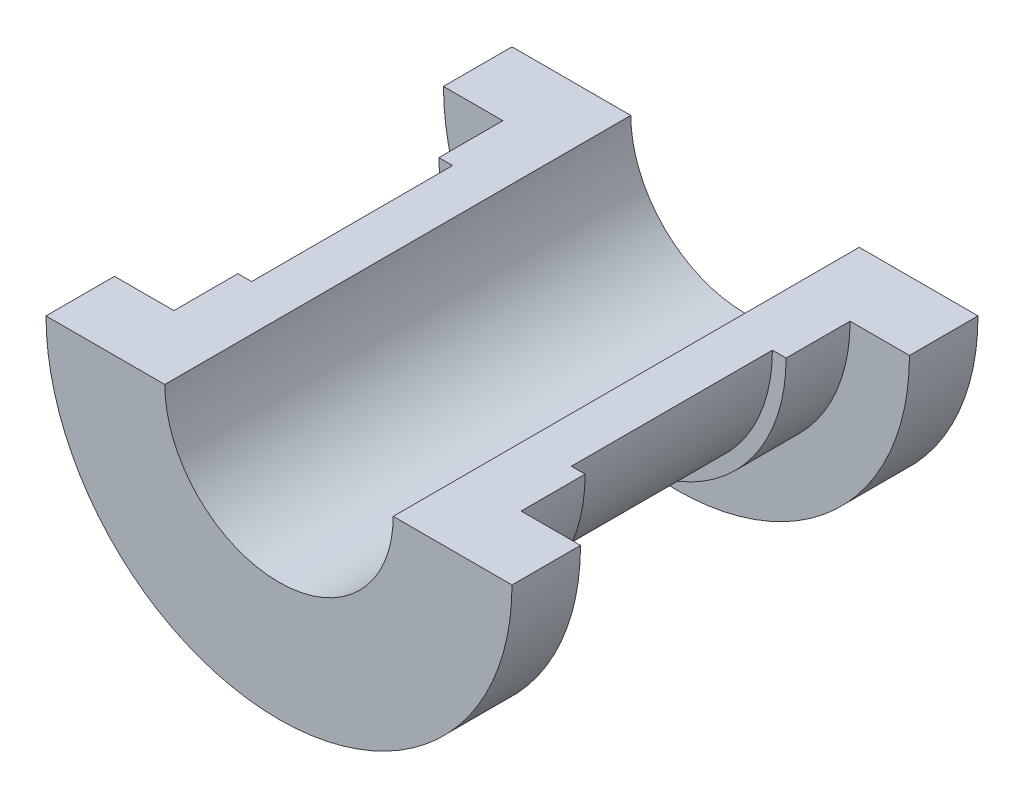
ISO-10303-21;
HEADER;
FILE_DESCRIPTION(('STEP AP214'),'2;1');
FILE_NAME('part.step','',(''),(''),'','','');
FILE_SCHEMA(('AUTOMOTIVE_DESIGN { 1 0 10303 214 1 1 1 1 }'));
ENDSEC;
DATA;
#1=APPLICATION_CONTEXT('core data for automotive mechanical design processes');
#2=APPLICATION_PROTOCOL_DEFINITION('international standard','automotive_design',2000,#1);
#3=PRODUCT_CONTEXT('',#1,'mechanical');
#4=PRODUCT('Part','Part','',(#3));
#5=PRODUCT_RELATED_PRODUCT_CATEGORY('part','',(#4));
#6=PRODUCT_DEFINITION_FORMATION('','',#4);
#7=PRODUCT_DEFINITION_CONTEXT('part definition',#1,'design');
#8=PRODUCT_DEFINITION('design','',#6,#7);
#9=PRODUCT_DEFINITION_SHAPE('','',#8);
#10=(LENGTH_UNIT() NAMED_UNIT(*) SI_UNIT(.MILLI.,.METRE.));
#11=(NAMED_UNIT(*) PLANE_ANGLE_UNIT() SI_UNIT($,.RADIAN.));
#12=(NAMED_UNIT(*) SI_UNIT($,.STERADIAN.) SOLID_ANGLE_UNIT());
#13=UNCERTAINTY_MEASURE_WITH_UNIT(LENGTH_MEASURE(1.E-05),#10,'distance_accuracy_value','');
#14=(GEOMETRIC_REPRESENTATION_CONTEXT(3) GLOBAL_UNCERTAINTY_ASSIGNED_CONTEXT((#13)) GLOBAL_UNIT_ASSIGNED_CONTEXT((#10,
#11,#12)) REPRESENTATION_CONTEXT('',''));
#15=CARTESIAN_POINT('',(0.,0.,0.));
#16=DIRECTION('',(0.,0.,1.));
#17=DIRECTION('',(1.,0.,0.));
#18=AXIS2_PLACEMENT_3D('',#15,#16,#17);
#19=CARTESIAN_POINT('',(0.,-23.5,0.));
#20=DIRECTION('',(0.,1.,0.));
#21=DIRECTION('',(0.,0.,1.));
#22=AXIS2_PLACEMENT_3D('',#19,#20,#21);
#23=CYLINDRICAL_SURFACE('',#22,3.);
#24=CARTESIAN_POINT('',(0.,-23.5,0.));
#25=DIRECTION('',(0.,-1.,0.));
#26=DIRECTION('',(0.,0.,-1.));
#27=AXIS2_PLACEMENT_3D('',#24,#25,#26);
#28=CIRCLE('',#27,3.);
#29=CARTESIAN_POINT('',(0.,-23.5,-3.));
#30=VERTEX_POINT('',#29);
#31=EDGE_CURVE('E11',#30,#30,#28,.T.);
#32=ORIENTED_EDGE('',*,*,#31,.F.);
#33=EDGE_LOOP('',(#32));
#34=FACE_BOUND('',#33,.T.);
#35=CARTESIAN_POINT('',(0.,-17.5,0.));
#36=DIRECTION('',(0.,-1.,0.));
#37=DIRECTION('',(0.,0.,-1.));
#38=AXIS2_PLACEMENT_3D('',#35,#36,#37);
#39=CIRCLE('',#38,3.);
#40=CARTESIAN_POINT('',(0.,-17.5,-3.));
#41=VERTEX_POINT('',#40);
#42=EDGE_CURVE('E44',#41,#41,#39,.T.);
#43=ORIENTED_EDGE('',*,*,#42,.T.);
#44=EDGE_LOOP('',(#43));
#45=FACE_BOUND('',#44,.T.);
#46=ADVANCED_FACE('F41',(#34,#45),#23,.T.);
#47=CARTESIAN_POINT('',(0.,-23.5,0.));
#48=DIRECTION('',(0.,-1.,0.));
#49=DIRECTION('',(0.,0.,-1.));
#50=AXIS2_PLACEMENT_3D('',#47,#48,#49);
#51=PLANE('',#50);
#52=ORIENTED_EDGE('',*,*,#31,.T.);
#53=EDGE_LOOP('',(#52));
#54=FACE_BOUND('',#53,.T.);
#55=ADVANCED_FACE('F56',(#54),#51,.T.);
#56=CARTESIAN_POINT('',(0.,-17.5,0.));
#57=DIRECTION('',(0.,-1.,0.));
#58=DIRECTION('',(0.,0.,-1.));
#59=AXIS2_PLACEMENT_3D('',#56,#57,#58);
#60=PLANE('',#59);
#61=ORIENTED_EDGE('',*,*,#42,.F.);
#62=EDGE_LOOP('',(#61));
#63=FACE_BOUND('',#62,.T.);
#64=ADVANCED_FACE('F54',(#63),#60,.F.);
#65=CLOSED_SHELL('',(#46,#55,#64));
#66=MANIFOLD_SOLID_BREP('B2',#65);
#67=CARTESIAN_POINT('',(25.5,1.78065548281E-13,-25.5));
#68=DIRECTION('',(0.,0.,-1.));
#69=DIRECTION('',(-1.,0.,0.));
#70=AXIS2_PLACEMENT_3D('',#67,#68,#69);
#71=PLANE('',#70);
#72=CARTESIAN_POINT('',(0.,0.,-25.5));
#73=DIRECTION('',(0.,0.,-1.));
#74=DIRECTION('',(-1.,0.,0.));
#75=AXIS2_PLACEMENT_3D('',#72,#73,#74);
#76=CIRCLE('',#75,12.5);
#77=CARTESIAN_POINT('',(12.5,0.,-25.5));
#78=VERTEX_POINT('',#77);
#79=CARTESIAN_POINT('',(-12.5,0.,-25.5));
#80=VERTEX_POINT('',#79);
#81=EDGE_CURVE('E39',#78,#80,#76,.T.);
#82=ORIENTED_EDGE('',*,*,#81,.F.);
#83=DIRECTION('',(1.,0.,0.));
#84=VECTOR('',#83,1.);
#85=CARTESIAN_POINT('',(25.5,1.78065548281E-13,-25.5));
#86=LINE('',#85,#84);
#87=CARTESIAN_POINT('',(25.5,1.78065548281E-13,-25.5));
#88=VERTEX_POINT('',#87);
#89=EDGE_CURVE('E171',#78,#88,#86,.T.);
#90=ORIENTED_EDGE('',*,*,#89,.T.);
#91=CARTESIAN_POINT('',(0.,0.,-25.5));
#92=DIRECTION('',(0.,0.,-1.));
#93=DIRECTION('',(-1.,0.,0.));
#94=AXIS2_PLACEMENT_3D('',#91,#92,#93);
#95=CIRCLE('',#94,25.5);
#96=CARTESIAN_POINT('',(-25.5,0.,-25.5));
#97=VERTEX_POINT('',#96);
#98=EDGE_CURVE('E166',#88,#97,#95,.T.);
#99=ORIENTED_EDGE('',*,*,#98,.T.);
#100=DIRECTION('',(-1.,0.,0.));
#101=VECTOR('',#100,1.);
#102=CARTESIAN_POINT('',(-25.5,0.,-25.5));
#103=LINE('',#102,#101);
#104=EDGE_CURVE('E169',#80,#97,#103,.T.);
#105=ORIENTED_EDGE('',*,*,#104,.F.);
#106=EDGE_LOOP('',(#82,#90,#99,#105));
#107=FACE_BOUND('',#106,.T.);
#108=ADVANCED_FACE('F82',(#107),#71,.T.);
#109=CARTESIAN_POINT('',(0.,0.,0.));
#110=DIRECTION('',(0.,0.,-1.));
#111=DIRECTION('',(-1.,0.,0.));
#112=AXIS2_PLACEMENT_3D('',#109,#110,#111);
#113=CYLINDRICAL_SURFACE('',#112,12.5);
#114=CARTESIAN_POINT('',(0.,0.,25.5));
#115=DIRECTION('',(0.,0.,-1.));
#116=DIRECTION('',(-1.,0.,0.));
#117=AXIS2_PLACEMENT_3D('',#114,#115,#116);
#118=CIRCLE('',#117,12.5);
#119=CARTESIAN_POINT('',(12.5,0.,25.5));
#120=VERTEX_POINT('',#119);
#121=CARTESIAN_POINT('',(-12.5,0.,25.5));
#122=VERTEX_POINT('',#121);
#123=EDGE_CURVE('E90',#120,#122,#118,.T.);
#124=ORIENTED_EDGE('',*,*,#123,.F.);
#125=DIRECTION('',(0.,0.,-1.));
#126=VECTOR('',#125,1.);
#127=CARTESIAN_POINT('',(12.5,0.,-25.5));
#128=LINE('',#127,#126);
#129=EDGE_CURVE('E176',#120,#78,#128,.T.);
#130=ORIENTED_EDGE('',*,*,#129,.T.);
#131=ORIENTED_EDGE('',*,*,#81,.T.);
#132=DIRECTION('',(0.,0.,-1.));
#133=VECTOR('',#132,1.);
#134=CARTESIAN_POINT('',(-12.5,0.,-25.5));
#135=LINE('',#134,#133);
#136=EDGE_CURVE('E189',#122,#80,#135,.T.);
#137=ORIENTED_EDGE('',*,*,#136,.F.);
#138=EDGE_LOOP('',(#124,#130,#131,#137));
#139=FACE_BOUND('',#138,.T.);
#140=ADVANCED_FACE('F84',(#139),#113,.F.);
#141=CARTESIAN_POINT('',(25.5,1.78065548281E-13,25.5));
#142=DIRECTION('',(0.,0.,1.));
#143=DIRECTION('',(1.,0.,0.));
#144=AXIS2_PLACEMENT_3D('',#141,#142,#143);
#145=PLANE('',#144);
#146=CARTESIAN_POINT('',(0.,0.,25.5));
#147=DIRECTION('',(0.,0.,-1.));
#148=DIRECTION('',(-1.,0.,0.));
#149=AXIS2_PLACEMENT_3D('',#146,#147,#148);
#150=CIRCLE('',#149,25.5);
#151=CARTESIAN_POINT('',(25.5,1.78065548281E-13,25.5));
#152=VERTEX_POINT('',#151);
#153=CARTESIAN_POINT('',(-25.5,0.,25.5));
#154=VERTEX_POINT('',#153);
#155=EDGE_CURVE('E262',#152,#154,#150,.T.);
#156=ORIENTED_EDGE('',*,*,#155,.F.);
#157=DIRECTION('',(-1.,0.,0.));
#158=VECTOR('',#157,1.);
#159=CARTESIAN_POINT('',(25.5,1.78065548281E-13,25.5));
#160=LINE('',#159,#158);
#161=EDGE_CURVE('E244',#152,#120,#160,.T.);
#162=ORIENTED_EDGE('',*,*,#161,.T.);
#163=ORIENTED_EDGE('',*,*,#123,.T.);
#164=DIRECTION('',(1.,0.,0.));
#165=VECTOR('',#164,1.);
#166=CARTESIAN_POINT('',(-25.5,0.,25.5));
#167=LINE('',#166,#165);
#168=EDGE_CURVE('E214',#154,#122,#167,.T.);
#169=ORIENTED_EDGE('',*,*,#168,.F.);
#170=EDGE_LOOP('',(#156,#162,#163,#169));
#171=FACE_BOUND('',#170,.T.);
#172=ADVANCED_FACE('F265',(#171),#145,.T.);
#173=CARTESIAN_POINT('',(0.,0.,0.));
#174=DIRECTION('',(0.,0.,-1.));
#175=DIRECTION('',(-1.,0.,0.));
#176=AXIS2_PLACEMENT_3D('',#173,#174,#175);
#177=CYLINDRICAL_SURFACE('',#176,25.5);
#178=CARTESIAN_POINT('',(0.,0.,18.));
#179=DIRECTION('',(0.,0.,-1.));
#180=DIRECTION('',(-1.,0.,0.));
#181=AXIS2_PLACEMENT_3D('',#178,#179,#180);
#182=CIRCLE('',#181,25.5);
#183=CARTESIAN_POINT('',(25.5,1.78065548281E-13,18.));
#184=VERTEX_POINT('',#183);
#185=CARTESIAN_POINT('',(-25.5,0.,18.));
#186=VERTEX_POINT('',#185);
#187=EDGE_CURVE('E260',#184,#186,#182,.T.);
#188=ORIENTED_EDGE('',*,*,#187,.F.);
#189=DIRECTION('',(0.,0.,1.));
#190=VECTOR('',#189,1.);
#191=CARTESIAN_POINT('',(25.5,1.78065548281E-13,25.5));
#192=LINE('',#191,#190);
#193=EDGE_CURVE('E241',#184,#152,#192,.T.);
#194=ORIENTED_EDGE('',*,*,#193,.T.);
#195=ORIENTED_EDGE('',*,*,#155,.T.);
#196=DIRECTION('',(0.,0.,1.));
#197=VECTOR('',#196,1.);
#198=CARTESIAN_POINT('',(-25.5,0.,25.5));
#199=LINE('',#198,#197);
#200=EDGE_CURVE('E211',#186,#154,#199,.T.);
#201=ORIENTED_EDGE('',*,*,#200,.F.);
#202=EDGE_LOOP('',(#188,#194,#195,#201));
#203=FACE_BOUND('',#202,.T.);
#204=ADVANCED_FACE('F300',(#203),#177,.T.);
#205=CARTESIAN_POINT('',(25.5,1.78065548281E-13,18.));
#206=DIRECTION('',(0.,0.,-1.));
#207=DIRECTION('',(-1.,0.,0.));
#208=AXIS2_PLACEMENT_3D('',#205,#206,#207);
#209=PLANE('',#208);
#210=CARTESIAN_POINT('',(0.,0.,18.));
#211=DIRECTION('',(0.,0.,-1.));
#212=DIRECTION('',(-1.,0.,0.));
#213=AXIS2_PLACEMENT_3D('',#210,#211,#212);
#214=CIRCLE('',#213,19.);
#215=CARTESIAN_POINT('',(19.,1.32676290876039E-13,18.));
#216=VERTEX_POINT('',#215);
#217=CARTESIAN_POINT('',(-19.,0.,18.));
#218=VERTEX_POINT('',#217);
#219=EDGE_CURVE('E258',#216,#218,#214,.T.);
#220=ORIENTED_EDGE('',*,*,#219,.F.);
#221=DIRECTION('',(1.,0.,0.));
#222=VECTOR('',#221,1.);
#223=CARTESIAN_POINT('',(25.5,1.78065548281E-13,18.));
#224=LINE('',#223,#222);
#225=EDGE_CURVE('E238',#216,#184,#224,.T.);
#226=ORIENTED_EDGE('',*,*,#225,.T.);
#227=ORIENTED_EDGE('',*,*,#187,.T.);
#228=DIRECTION('',(-1.,0.,0.));
#229=VECTOR('',#228,1.);
#230=CARTESIAN_POINT('',(-25.5,0.,18.));
#231=LINE('',#230,#229);
#232=EDGE_CURVE('E208',#218,#186,#231,.T.);
#233=ORIENTED_EDGE('',*,*,#232,.F.);
#234=EDGE_LOOP('',(#220,#226,#227,#233));
#235=FACE_BOUND('',#234,.T.);
#236=ADVANCED_FACE('F297',(#235),#209,.T.);
#237=CARTESIAN_POINT('',(0.,0.,0.));
#238=DIRECTION('',(0.,0.,-1.));
#239=DIRECTION('',(-1.,0.,0.));
#240=AXIS2_PLACEMENT_3D('',#237,#238,#239);
#241=CYLINDRICAL_SURFACE('',#240,19.);
#242=CARTESIAN_POINT('',(0.,0.,11.));
#243=DIRECTION('',(0.,0.,-1.));
#244=DIRECTION('',(-1.,0.,0.));
#245=AXIS2_PLACEMENT_3D('',#242,#243,#244);
#246=CIRCLE('',#245,19.);
#247=CARTESIAN_POINT('',(19.,1.32676290876039E-13,11.));
#248=VERTEX_POINT('',#247);
#249=CARTESIAN_POINT('',(-19.,0.,11.));
#250=VERTEX_POINT('',#249);
#251=EDGE_CURVE('E256',#248,#250,#246,.T.);
#252=ORIENTED_EDGE('',*,*,#251,.F.);
#253=DIRECTION('',(0.,0.,1.));
#254=VECTOR('',#253,1.);
#255=CARTESIAN_POINT('',(19.,1.32676290876039E-13,18.));
#256=LINE('',#255,#254);
#257=EDGE_CURVE('E235',#248,#216,#256,.T.);
#258=ORIENTED_EDGE('',*,*,#257,.T.);
#259=ORIENTED_EDGE('',*,*,#219,.T.);
#260=DIRECTION('',(0.,0.,1.));
#261=VECTOR('',#260,1.);
#262=CARTESIAN_POINT('',(-19.,0.,18.));
#263=LINE('',#262,#261);
#264=EDGE_CURVE('E205',#250,#218,#263,.T.);
#265=ORIENTED_EDGE('',*,*,#264,.F.);
#266=EDGE_LOOP('',(#252,#258,#259,#265));
#267=FACE_BOUND('',#266,.T.);
#268=ADVANCED_FACE('F294',(#267),#241,.T.);
#269=CARTESIAN_POINT('',(19.,1.32676290876039E-13,11.));
#270=DIRECTION('',(0.,0.,-1.));
#271=DIRECTION('',(-1.,0.,0.));
#272=AXIS2_PLACEMENT_3D('',#269,#270,#271);
#273=PLANE('',#272);
#274=CARTESIAN_POINT('',(0.,0.,11.));
#275=DIRECTION('',(0.,0.,-1.));
#276=DIRECTION('',(-1.,0.,0.));
#277=AXIS2_PLACEMENT_3D('',#274,#275,#276);
#278=CIRCLE('',#277,17.5);
#279=CARTESIAN_POINT('',(17.5,1.2220184685951E-13,11.));
#280=VERTEX_POINT('',#279);
#281=CARTESIAN_POINT('',(-17.5,0.,11.));
#282=VERTEX_POINT('',#281);
#283=EDGE_CURVE('E254',#280,#282,#278,.T.);
#284=ORIENTED_EDGE('',*,*,#283,.F.);
#285=DIRECTION('',(1.,0.,0.));
#286=VECTOR('',#285,1.);
#287=CARTESIAN_POINT('',(19.,1.32676290876039E-13,11.));
#288=LINE('',#287,#286);
#289=EDGE_CURVE('E232',#280,#248,#288,.T.);
#290=ORIENTED_EDGE('',*,*,#289,.T.);
#291=ORIENTED_EDGE('',*,*,#251,.T.);
#292=DIRECTION('',(-1.,0.,0.));
#293=VECTOR('',#292,1.);
#294=CARTESIAN_POINT('',(-19.,0.,11.));
#295=LINE('',#294,#293);
#296=EDGE_CURVE('E202',#282,#250,#295,.T.);
#297=ORIENTED_EDGE('',*,*,#296,.F.);
#298=EDGE_LOOP('',(#284,#290,#291,#297));
#299=FACE_BOUND('',#298,.T.);
#300=ADVANCED_FACE('F289',(#299),#273,.T.);
#301=CARTESIAN_POINT('',(0.,0.,0.));
#302=DIRECTION('',(0.,0.,-1.));
#303=DIRECTION('',(-1.,0.,0.));
#304=AXIS2_PLACEMENT_3D('',#301,#302,#303);
#305=CYLINDRICAL_SURFACE('',#304,17.5);
#306=CARTESIAN_POINT('',(0.,0.,-11.));
#307=DIRECTION('',(0.,0.,-1.));
#308=DIRECTION('',(-1.,0.,0.));
#309=AXIS2_PLACEMENT_3D('',#306,#307,#308);
#310=CIRCLE('',#309,17.5);
#311=CARTESIAN_POINT('',(17.5,1.2220184685951E-13,-11.));
#312=VERTEX_POINT('',#311);
#313=CARTESIAN_POINT('',(-17.5,0.,-11.));
#314=VERTEX_POINT('',#313);
#315=EDGE_CURVE('E252',#312,#314,#310,.T.);
#316=ORIENTED_EDGE('',*,*,#315,.F.);
#317=DIRECTION('',(0.,0.,1.));
#318=VECTOR('',#317,1.);
#319=CARTESIAN_POINT('',(17.5,1.2220184685951E-13,-11.));
#320=LINE('',#319,#318);
#321=EDGE_CURVE('E229',#312,#280,#320,.T.);
#322=ORIENTED_EDGE('',*,*,#321,.T.);
#323=ORIENTED_EDGE('',*,*,#283,.T.);
#324=DIRECTION('',(0.,0.,1.));
#325=VECTOR('',#324,1.);
#326=CARTESIAN_POINT('',(-17.5,0.,-11.));
#327=LINE('',#326,#325);
#328=EDGE_CURVE('E199',#314,#282,#327,.T.);
#329=ORIENTED_EDGE('',*,*,#328,.F.);
#330=EDGE_LOOP('',(#316,#322,#323,#329));
#331=FACE_BOUND('',#330,.T.);
#332=ADVANCED_FACE('F286',(#331),#305,.T.);
#333=CARTESIAN_POINT('',(19.,1.32676290876039E-13,-11.));
#334=DIRECTION('',(0.,0.,1.));
#335=DIRECTION('',(1.,0.,0.));
#336=AXIS2_PLACEMENT_3D('',#333,#334,#335);
#337=PLANE('',#336);
#338=CARTESIAN_POINT('',(0.,0.,-11.));
#339=DIRECTION('',(0.,0.,-1.));
#340=DIRECTION('',(-1.,0.,0.));
#341=AXIS2_PLACEMENT_3D('',#338,#339,#340);
#342=CIRCLE('',#341,19.);
#343=CARTESIAN_POINT('',(19.,1.32676290876039E-13,-11.));
#344=VERTEX_POINT('',#343);
#345=CARTESIAN_POINT('',(-19.,0.,-11.));
#346=VERTEX_POINT('',#345);
#347=EDGE_CURVE('E250',#344,#346,#342,.T.);
#348=ORIENTED_EDGE('',*,*,#347,.F.);
#349=DIRECTION('',(-1.,0.,0.));
#350=VECTOR('',#349,1.);
#351=CARTESIAN_POINT('',(19.,1.32676290876039E-13,-11.));
#352=LINE('',#351,#350);
#353=EDGE_CURVE('E226',#344,#312,#352,.T.);
#354=ORIENTED_EDGE('',*,*,#353,.T.);
#355=ORIENTED_EDGE('',*,*,#315,.T.);
#356=DIRECTION('',(1.,0.,0.));
#357=VECTOR('',#356,1.);
#358=CARTESIAN_POINT('',(-19.,0.,-11.));
#359=LINE('',#358,#357);
#360=EDGE_CURVE('E196',#346,#314,#359,.T.);
#361=ORIENTED_EDGE('',*,*,#360,.F.);
#362=EDGE_LOOP('',(#348,#354,#355,#361));
#363=FACE_BOUND('',#362,.T.);
#364=ADVANCED_FACE('F281',(#363),#337,.T.);
#365=CARTESIAN_POINT('',(0.,0.,0.));
#366=DIRECTION('',(0.,0.,-1.));
#367=DIRECTION('',(-1.,0.,0.));
#368=AXIS2_PLACEMENT_3D('',#365,#366,#367);
#369=CYLINDRICAL_SURFACE('',#368,19.);
#370=CARTESIAN_POINT('',(0.,0.,-18.));
#371=DIRECTION('',(0.,0.,-1.));
#372=DIRECTION('',(-1.,0.,0.));
#373=AXIS2_PLACEMENT_3D('',#370,#371,#372);
#374=CIRCLE('',#373,19.);
#375=CARTESIAN_POINT('',(19.,1.32676290876039E-13,-18.));
#376=VERTEX_POINT('',#375);
#377=CARTESIAN_POINT('',(-19.,0.,-18.));
#378=VERTEX_POINT('',#377);
#379=EDGE_CURVE('E248',#376,#378,#374,.T.);
#380=ORIENTED_EDGE('',*,*,#379,.F.);
#381=DIRECTION('',(0.,0.,1.));
#382=VECTOR('',#381,1.);
#383=CARTESIAN_POINT('',(19.,1.32676290876039E-13,-18.));
#384=LINE('',#383,#382);
#385=EDGE_CURVE('E223',#376,#344,#384,.T.);
#386=ORIENTED_EDGE('',*,*,#385,.T.);
#387=ORIENTED_EDGE('',*,*,#347,.T.);
#388=DIRECTION('',(0.,0.,1.));
#389=VECTOR('',#388,1.);
#390=CARTESIAN_POINT('',(-19.,0.,-18.));
#391=LINE('',#390,#389);
#392=EDGE_CURVE('E193',#378,#346,#391,.T.);
#393=ORIENTED_EDGE('',*,*,#392,.F.);
#394=EDGE_LOOP('',(#380,#386,#387,#393));
#395=FACE_BOUND('',#394,.T.);
#396=ADVANCED_FACE('F279',(#395),#369,.T.);
#397=CARTESIAN_POINT('',(25.5,1.78065548281E-13,-18.));
#398=DIRECTION('',(0.,0.,1.));
#399=DIRECTION('',(1.,0.,0.));
#400=AXIS2_PLACEMENT_3D('',#397,#398,#399);
#401=PLANE('',#400);
#402=CARTESIAN_POINT('',(0.,0.,-18.));
#403=DIRECTION('',(0.,0.,-1.));
#404=DIRECTION('',(-1.,0.,0.));
#405=AXIS2_PLACEMENT_3D('',#402,#403,#404);
#406=CIRCLE('',#405,25.5);
#407=CARTESIAN_POINT('',(25.5,1.78065548281E-13,-18.));
#408=VERTEX_POINT('',#407);
#409=CARTESIAN_POINT('',(-25.5,0.,-18.));
#410=VERTEX_POINT('',#409);
#411=EDGE_CURVE('E175',#408,#410,#406,.T.);
#412=ORIENTED_EDGE('',*,*,#411,.F.);
#413=DIRECTION('',(-1.,0.,0.));
#414=VECTOR('',#413,1.);
#415=CARTESIAN_POINT('',(25.5,1.78065548281E-13,-18.));
#416=LINE('',#415,#414);
#417=EDGE_CURVE('E220',#408,#376,#416,.T.);
#418=ORIENTED_EDGE('',*,*,#417,.T.);
#419=ORIENTED_EDGE('',*,*,#379,.T.);
#420=DIRECTION('',(1.,0.,0.));
#421=VECTOR('',#420,1.);
#422=CARTESIAN_POINT('',(-25.5,0.,-18.));
#423=LINE('',#422,#421);
#424=EDGE_CURVE('E184',#410,#378,#423,.T.);
#425=ORIENTED_EDGE('',*,*,#424,.F.);
#426=EDGE_LOOP('',(#412,#418,#419,#425));
#427=FACE_BOUND('',#426,.T.);
#428=ADVANCED_FACE('F275',(#427),#401,.T.);
#429=CARTESIAN_POINT('',(0.,0.,0.));
#430=DIRECTION('',(0.,0.,-1.));
#431=DIRECTION('',(-1.,0.,0.));
#432=AXIS2_PLACEMENT_3D('',#429,#430,#431);
#433=CYLINDRICAL_SURFACE('',#432,25.5);
#434=DIRECTION('',(0.,0.,1.));
#435=VECTOR('',#434,1.);
#436=CARTESIAN_POINT('',(25.5,1.78065548281E-13,-25.5));
#437=LINE('',#436,#435);
#438=EDGE_CURVE('E218',#88,#408,#437,.T.);
#439=ORIENTED_EDGE('',*,*,#438,.T.);
#440=ORIENTED_EDGE('',*,*,#411,.T.);
#441=DIRECTION('',(0.,0.,1.));
#442=VECTOR('',#441,1.);
#443=CARTESIAN_POINT('',(-25.5,0.,-25.5));
#444=LINE('',#443,#442);
#445=EDGE_CURVE('E179',#97,#410,#444,.T.);
#446=ORIENTED_EDGE('',*,*,#445,.F.);
#447=ORIENTED_EDGE('',*,*,#98,.F.);
#448=EDGE_LOOP('',(#439,#440,#446,#447));
#449=FACE_BOUND('',#448,.T.);
#450=ADVANCED_FACE('F180',(#449),#433,.T.);
#451=CARTESIAN_POINT('',(0.,0.,0.));
#452=DIRECTION('',(0.,1.,0.));
#453=DIRECTION('',(0.,0.,-1.));
#454=AXIS2_PLACEMENT_3D('',#451,#452,#453);
#455=PLANE('',#454);
#456=ORIENTED_EDGE('',*,*,#89,.F.);
#457=ORIENTED_EDGE('',*,*,#129,.F.);
#458=ORIENTED_EDGE('',*,*,#161,.F.);
#459=ORIENTED_EDGE('',*,*,#193,.F.);
#460=ORIENTED_EDGE('',*,*,#225,.F.);
#461=ORIENTED_EDGE('',*,*,#257,.F.);
#462=ORIENTED_EDGE('',*,*,#289,.F.);
#463=ORIENTED_EDGE('',*,*,#321,.F.);
#464=ORIENTED_EDGE('',*,*,#353,.F.);
#465=ORIENTED_EDGE('',*,*,#385,.F.);
#466=ORIENTED_EDGE('',*,*,#417,.F.);
#467=ORIENTED_EDGE('',*,*,#438,.F.);
#468=EDGE_LOOP('',(#456,#457,#458,#459,#460,#461,#462,#463,#464,#465,#466,#467));
#469=FACE_BOUND('',#468,.T.);
#470=ADVANCED_FACE('F270',(#469),#455,.T.);
#471=CARTESIAN_POINT('',(0.,0.,0.));
#472=DIRECTION('',(0.,-1.,0.));
#473=DIRECTION('',(0.,0.,-1.));
#474=AXIS2_PLACEMENT_3D('',#471,#472,#473);
#475=PLANE('',#474);
#476=ORIENTED_EDGE('',*,*,#104,.T.);
#477=ORIENTED_EDGE('',*,*,#445,.T.);
#478=ORIENTED_EDGE('',*,*,#424,.T.);
#479=ORIENTED_EDGE('',*,*,#392,.T.);
#480=ORIENTED_EDGE('',*,*,#360,.T.);
#481=ORIENTED_EDGE('',*,*,#328,.T.);
#482=ORIENTED_EDGE('',*,*,#296,.T.);
#483=ORIENTED_EDGE('',*,*,#264,.T.);
#484=ORIENTED_EDGE('',*,*,#232,.T.);
#485=ORIENTED_EDGE('',*,*,#200,.T.);
#486=ORIENTED_EDGE('',*,*,#168,.T.);
#487=ORIENTED_EDGE('',*,*,#136,.T.);
#488=EDGE_LOOP('',(#476,#477,#478,#479,#480,#481,#482,#483,#484,#485,#486,#487));
#489=FACE_BOUND('',#488,.T.);
#490=ADVANCED_FACE('F187',(#489),#475,.F.);
#491=CLOSED_SHELL('',(#108,#140,#172,#204,#236,#268,#300,#332,#364,#396,#428,#450,#470,#490));
#492=MANIFOLD_SOLID_BREP('B6',#491);
#493=ADVANCED_BREP_SHAPE_REPRESENTATION('',(#18,#66,#492),#14);
#494=SHAPE_DEFINITION_REPRESENTATION(#9,#493);
ENDSEC;
END-ISO-10303-21;
